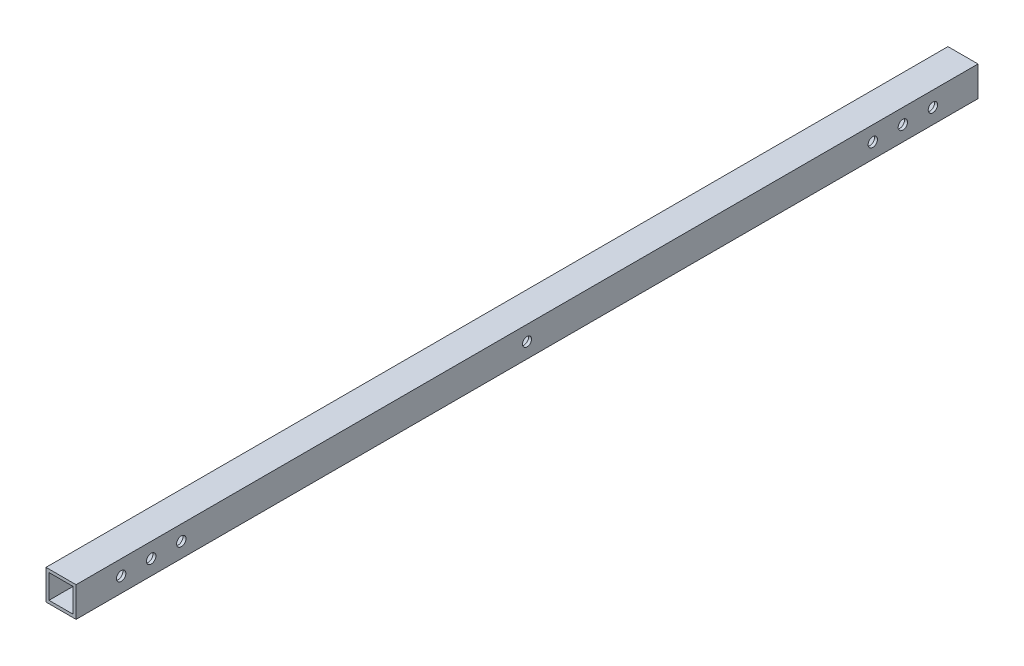
ISO-10303-21;
HEADER;
FILE_DESCRIPTION(('STEP AP214'),'2;1');
FILE_NAME('part.step','',(''),(''),'','','');
FILE_SCHEMA(('AUTOMOTIVE_DESIGN { 1 0 10303 214 1 1 1 1 }'));
ENDSEC;
DATA;
#1=APPLICATION_CONTEXT('core data for automotive mechanical design processes');
#2=APPLICATION_PROTOCOL_DEFINITION('international standard','automotive_design',2000,#1);
#3=PRODUCT_CONTEXT('',#1,'mechanical');
#4=PRODUCT('Part','Part','',(#3));
#5=PRODUCT_RELATED_PRODUCT_CATEGORY('part','',(#4));
#6=PRODUCT_DEFINITION_FORMATION('','',#4);
#7=PRODUCT_DEFINITION_CONTEXT('part definition',#1,'design');
#8=PRODUCT_DEFINITION('design','',#6,#7);
#9=PRODUCT_DEFINITION_SHAPE('','',#8);
#10=(LENGTH_UNIT() NAMED_UNIT(*) SI_UNIT(.MILLI.,.METRE.));
#11=(NAMED_UNIT(*) PLANE_ANGLE_UNIT() SI_UNIT($,.RADIAN.));
#12=(NAMED_UNIT(*) SI_UNIT($,.STERADIAN.) SOLID_ANGLE_UNIT());
#13=UNCERTAINTY_MEASURE_WITH_UNIT(LENGTH_MEASURE(1.E-05),#10,'distance_accuracy_value','');
#14=(GEOMETRIC_REPRESENTATION_CONTEXT(3) GLOBAL_UNCERTAINTY_ASSIGNED_CONTEXT((#13)) GLOBAL_UNIT_ASSIGNED_CONTEXT((#10,
#11,#12)) REPRESENTATION_CONTEXT('',''));
#15=CARTESIAN_POINT('',(0.,0.,0.));
#16=DIRECTION('',(0.,0.,1.));
#17=DIRECTION('',(1.,0.,0.));
#18=AXIS2_PLACEMENT_3D('',#15,#16,#17);
#19=CARTESIAN_POINT('',(10.,0.135119806497659,39.9728269370058));
#20=DIRECTION('',(-1.,0.,0.));
#21=DIRECTION('',(0.,0.,1.));
#22=AXIS2_PLACEMENT_3D('',#19,#20,#21);
#23=CYLINDRICAL_SURFACE('',#22,1.55843393281074);
#24=CARTESIAN_POINT('',(0.999999999999999,0.135119806497659,39.9728269370058));
#25=DIRECTION('',(-1.,0.,0.));
#26=DIRECTION('',(0.,-1.,0.));
#27=AXIS2_PLACEMENT_3D('',#24,#25,#26);
#28=CIRCLE('',#27,1.55843393281074);
#29=CARTESIAN_POINT('',(0.999999999999999,-1.42331412631308,39.9728269370058));
#30=VERTEX_POINT('',#29);
#31=EDGE_CURVE('E174',#30,#30,#28,.T.);
#32=ORIENTED_EDGE('',*,*,#31,.F.);
#33=EDGE_LOOP('',(#32));
#34=FACE_BOUND('',#33,.T.);
#35=CARTESIAN_POINT('',(0.,0.135119806497659,39.9728269370058));
#36=DIRECTION('',(1.,0.,0.));
#37=DIRECTION('',(0.,0.,-1.));
#38=AXIS2_PLACEMENT_3D('',#35,#36,#37);
#39=CIRCLE('',#38,1.55843393281074);
#40=CARTESIAN_POINT('',(0.,0.135119806497659,38.4143930041951));
#41=VERTEX_POINT('',#40);
#42=EDGE_CURVE('E211',#41,#41,#39,.T.);
#43=ORIENTED_EDGE('',*,*,#42,.F.);
#44=EDGE_LOOP('',(#43));
#45=FACE_BOUND('',#44,.T.);
#46=ADVANCED_FACE('F36',(#34,#45),#23,.F.);
#47=CARTESIAN_POINT('',(10.,0.135119806497659,29.9728269370058));
#48=DIRECTION('',(-1.,0.,0.));
#49=DIRECTION('',(0.,0.,1.));
#50=AXIS2_PLACEMENT_3D('',#47,#48,#49);
#51=CYLINDRICAL_SURFACE('',#50,1.55843393281074);
#52=CARTESIAN_POINT('',(0.999999999999999,0.135119806497659,29.9728269370058));
#53=DIRECTION('',(-1.,0.,0.));
#54=DIRECTION('',(0.,-1.,0.));
#55=AXIS2_PLACEMENT_3D('',#52,#53,#54);
#56=CIRCLE('',#55,1.55843393281074);
#57=CARTESIAN_POINT('',(0.999999999999999,-1.42331412631308,29.9728269370058));
#58=VERTEX_POINT('',#57);
#59=EDGE_CURVE('E171',#58,#58,#56,.T.);
#60=ORIENTED_EDGE('',*,*,#59,.F.);
#61=EDGE_LOOP('',(#60));
#62=FACE_BOUND('',#61,.T.);
#63=CARTESIAN_POINT('',(0.,0.135119806497659,29.9728269370058));
#64=DIRECTION('',(1.,0.,0.));
#65=DIRECTION('',(0.,0.,-1.));
#66=AXIS2_PLACEMENT_3D('',#63,#64,#65);
#67=CIRCLE('',#66,1.55843393281074);
#68=CARTESIAN_POINT('',(0.,0.135119806497659,28.4143930041951));
#69=VERTEX_POINT('',#68);
#70=EDGE_CURVE('E205',#69,#69,#67,.T.);
#71=ORIENTED_EDGE('',*,*,#70,.F.);
#72=EDGE_LOOP('',(#71));
#73=FACE_BOUND('',#72,.T.);
#74=ADVANCED_FACE('F266',(#62,#73),#51,.F.);
#75=CARTESIAN_POINT('',(10.,0.135119806497659,19.9728269370058));
#76=DIRECTION('',(-1.,0.,0.));
#77=DIRECTION('',(0.,0.,1.));
#78=AXIS2_PLACEMENT_3D('',#75,#76,#77);
#79=CYLINDRICAL_SURFACE('',#78,1.55843393281074);
#80=CARTESIAN_POINT('',(0.999999999999999,0.135119806497659,19.9728269370058));
#81=DIRECTION('',(-1.,0.,0.));
#82=DIRECTION('',(0.,-1.,0.));
#83=AXIS2_PLACEMENT_3D('',#80,#81,#82);
#84=CIRCLE('',#83,1.55843393281074);
#85=CARTESIAN_POINT('',(0.999999999999999,-1.42331412631308,19.9728269370058));
#86=VERTEX_POINT('',#85);
#87=EDGE_CURVE('E168',#86,#86,#84,.T.);
#88=ORIENTED_EDGE('',*,*,#87,.F.);
#89=EDGE_LOOP('',(#88));
#90=FACE_BOUND('',#89,.T.);
#91=CARTESIAN_POINT('',(0.,0.135119806497659,19.9728269370058));
#92=DIRECTION('',(1.,0.,0.));
#93=DIRECTION('',(0.,0.,-1.));
#94=AXIS2_PLACEMENT_3D('',#91,#92,#93);
#95=CIRCLE('',#94,1.55843393281074);
#96=CARTESIAN_POINT('',(0.,0.135119806497659,18.414393004195));
#97=VERTEX_POINT('',#96);
#98=EDGE_CURVE('E199',#97,#97,#95,.T.);
#99=ORIENTED_EDGE('',*,*,#98,.F.);
#100=EDGE_LOOP('',(#99));
#101=FACE_BOUND('',#100,.T.);
#102=ADVANCED_FACE('F273',(#90,#101),#79,.F.);
#103=CARTESIAN_POINT('',(10.,0.135119806497659,-210.027173062994));
#104=DIRECTION('',(-1.,0.,0.));
#105=DIRECTION('',(0.,0.,1.));
#106=AXIS2_PLACEMENT_3D('',#103,#104,#105);
#107=CYLINDRICAL_SURFACE('',#106,1.55843393281073);
#108=CARTESIAN_POINT('',(0.999999999999999,0.135119806497659,-210.027173062994));
#109=DIRECTION('',(-1.,0.,0.));
#110=DIRECTION('',(0.,-1.,0.));
#111=AXIS2_PLACEMENT_3D('',#108,#109,#110);
#112=CIRCLE('',#111,1.55843393281073);
#113=CARTESIAN_POINT('',(0.999999999999999,-1.42331412631307,-210.027173062994));
#114=VERTEX_POINT('',#113);
#115=EDGE_CURVE('E165',#114,#114,#112,.T.);
#116=ORIENTED_EDGE('',*,*,#115,.F.);
#117=EDGE_LOOP('',(#116));
#118=FACE_BOUND('',#117,.T.);
#119=CARTESIAN_POINT('',(0.,0.135119806497659,-210.027173062994));
#120=DIRECTION('',(1.,0.,0.));
#121=DIRECTION('',(0.,0.,1.));
#122=AXIS2_PLACEMENT_3D('',#119,#120,#121);
#123=CIRCLE('',#122,1.55843393281073);
#124=CARTESIAN_POINT('',(0.,0.135119806497659,-208.468739130183));
#125=VERTEX_POINT('',#124);
#126=EDGE_CURVE('E193',#125,#125,#123,.T.);
#127=ORIENTED_EDGE('',*,*,#126,.F.);
#128=EDGE_LOOP('',(#127));
#129=FACE_BOUND('',#128,.T.);
#130=ADVANCED_FACE('F333',(#118,#129),#107,.F.);
#131=CARTESIAN_POINT('',(10.,0.135119806497659,-220.027173062994));
#132=DIRECTION('',(-1.,0.,0.));
#133=DIRECTION('',(0.,0.,1.));
#134=AXIS2_PLACEMENT_3D('',#131,#132,#133);
#135=CYLINDRICAL_SURFACE('',#134,1.55843393281078);
#136=CARTESIAN_POINT('',(0.999999999999999,0.135119806497659,-220.027173062994));
#137=DIRECTION('',(-1.,0.,0.));
#138=DIRECTION('',(0.,-1.,0.));
#139=AXIS2_PLACEMENT_3D('',#136,#137,#138);
#140=CIRCLE('',#139,1.55843393281078);
#141=CARTESIAN_POINT('',(0.999999999999999,-1.42331412631312,-220.027173062994));
#142=VERTEX_POINT('',#141);
#143=EDGE_CURVE('E162',#142,#142,#140,.T.);
#144=ORIENTED_EDGE('',*,*,#143,.F.);
#145=EDGE_LOOP('',(#144));
#146=FACE_BOUND('',#145,.T.);
#147=CARTESIAN_POINT('',(0.,0.135119806497659,-220.027173062994));
#148=DIRECTION('',(1.,0.,0.));
#149=DIRECTION('',(0.,0.,1.));
#150=AXIS2_PLACEMENT_3D('',#147,#148,#149);
#151=CIRCLE('',#150,1.55843393281078);
#152=CARTESIAN_POINT('',(0.,0.135119806497659,-218.468739130183));
#153=VERTEX_POINT('',#152);
#154=EDGE_CURVE('E187',#153,#153,#151,.T.);
#155=ORIENTED_EDGE('',*,*,#154,.F.);
#156=EDGE_LOOP('',(#155));
#157=FACE_BOUND('',#156,.T.);
#158=ADVANCED_FACE('F324',(#146,#157),#135,.F.);
#159=CARTESIAN_POINT('',(10.,0.135119806497659,-230.027173062994));
#160=DIRECTION('',(-1.,0.,0.));
#161=DIRECTION('',(0.,0.,1.));
#162=AXIS2_PLACEMENT_3D('',#159,#160,#161);
#163=CYLINDRICAL_SURFACE('',#162,1.55843393281076);
#164=CARTESIAN_POINT('',(0.999999999999999,0.135119806497659,-230.027173062994));
#165=DIRECTION('',(-1.,0.,0.));
#166=DIRECTION('',(0.,-1.,0.));
#167=AXIS2_PLACEMENT_3D('',#164,#165,#166);
#168=CIRCLE('',#167,1.55843393281076);
#169=CARTESIAN_POINT('',(0.999999999999999,-1.4233141263131,-230.027173062994));
#170=VERTEX_POINT('',#169);
#171=EDGE_CURVE('E159',#170,#170,#168,.T.);
#172=ORIENTED_EDGE('',*,*,#171,.F.);
#173=EDGE_LOOP('',(#172));
#174=FACE_BOUND('',#173,.T.);
#175=CARTESIAN_POINT('',(0.,0.135119806497659,-230.027173062994));
#176=DIRECTION('',(1.,0.,0.));
#177=DIRECTION('',(0.,0.,1.));
#178=AXIS2_PLACEMENT_3D('',#175,#176,#177);
#179=CIRCLE('',#178,1.55843393281076);
#180=CARTESIAN_POINT('',(0.,0.135119806497659,-228.468739130183));
#181=VERTEX_POINT('',#180);
#182=EDGE_CURVE('E181',#181,#181,#179,.T.);
#183=ORIENTED_EDGE('',*,*,#182,.F.);
#184=EDGE_LOOP('',(#183));
#185=FACE_BOUND('',#184,.T.);
#186=ADVANCED_FACE('F315',(#174,#185),#163,.F.);
#187=CARTESIAN_POINT('',(0.,0.135119806497659,-95.0271730629942));
#188=DIRECTION('',(1.,0.,0.));
#189=DIRECTION('',(0.,0.,-1.));
#190=AXIS2_PLACEMENT_3D('',#187,#188,#189);
#191=CYLINDRICAL_SURFACE('',#190,1.5);
#192=CARTESIAN_POINT('',(1.,0.135119806497659,-95.0271730629942));
#193=DIRECTION('',(-1.,0.,0.));
#194=DIRECTION('',(0.,-1.,0.));
#195=AXIS2_PLACEMENT_3D('',#192,#193,#194);
#196=CIRCLE('',#195,1.5);
#197=CARTESIAN_POINT('',(1.,-1.36488019350234,-95.0271730629942));
#198=VERTEX_POINT('',#197);
#199=EDGE_CURVE('E40',#198,#198,#196,.F.);
#200=ORIENTED_EDGE('',*,*,#199,.T.);
#201=EDGE_LOOP('',(#200));
#202=FACE_BOUND('',#201,.T.);
#203=CARTESIAN_POINT('',(0.,0.135119806497659,-95.0271730629942));
#204=DIRECTION('',(1.,0.,0.));
#205=DIRECTION('',(0.,0.,-1.));
#206=AXIS2_PLACEMENT_3D('',#203,#204,#205);
#207=CIRCLE('',#206,1.5);
#208=CARTESIAN_POINT('',(0.,0.135119806497659,-96.5271730629942));
#209=VERTEX_POINT('',#208);
#210=EDGE_CURVE('E178',#209,#209,#207,.T.);
#211=ORIENTED_EDGE('',*,*,#210,.F.);
#212=EDGE_LOOP('',(#211));
#213=FACE_BOUND('',#212,.T.);
#214=ADVANCED_FACE('F299',(#202,#213),#191,.F.);
#215=CARTESIAN_POINT('',(10.,0.,0.));
#216=DIRECTION('',(1.,0.,0.));
#217=DIRECTION('',(0.,0.,-1.));
#218=AXIS2_PLACEMENT_3D('',#215,#216,#217);
#219=PLANE('',#218);
#220=CARTESIAN_POINT('',(10.,0.135119806497659,-95.0271730629942));
#221=DIRECTION('',(1.,0.,0.));
#222=DIRECTION('',(0.,0.,-1.));
#223=AXIS2_PLACEMENT_3D('',#220,#221,#222);
#224=CIRCLE('',#223,1.5);
#225=CARTESIAN_POINT('',(10.,0.135119806497659,-96.5271730629942));
#226=VERTEX_POINT('',#225);
#227=EDGE_CURVE('E177',#226,#226,#224,.T.);
#228=ORIENTED_EDGE('',*,*,#227,.F.);
#229=EDGE_LOOP('',(#228));
#230=FACE_BOUND('',#229,.T.);
#231=CARTESIAN_POINT('',(10.,0.135119806497659,-220.027173062994));
#232=DIRECTION('',(1.,0.,0.));
#233=DIRECTION('',(0.,0.,1.));
#234=AXIS2_PLACEMENT_3D('',#231,#232,#233);
#235=CIRCLE('',#234,1.55843393281078);
#236=CARTESIAN_POINT('',(10.,0.135119806497659,-218.468739130183));
#237=VERTEX_POINT('',#236);
#238=EDGE_CURVE('E190',#237,#237,#235,.T.);
#239=ORIENTED_EDGE('',*,*,#238,.F.);
#240=EDGE_LOOP('',(#239));
#241=FACE_BOUND('',#240,.T.);
#242=CARTESIAN_POINT('',(10.,0.135119806497659,19.9728269370058));
#243=DIRECTION('',(1.,0.,0.));
#244=DIRECTION('',(0.,0.,-1.));
#245=AXIS2_PLACEMENT_3D('',#242,#243,#244);
#246=CIRCLE('',#245,1.55843393281074);
#247=CARTESIAN_POINT('',(10.,0.135119806497659,18.414393004195));
#248=VERTEX_POINT('',#247);
#249=EDGE_CURVE('E202',#248,#248,#246,.T.);
#250=ORIENTED_EDGE('',*,*,#249,.F.);
#251=EDGE_LOOP('',(#250));
#252=FACE_BOUND('',#251,.T.);
#253=CARTESIAN_POINT('',(10.,0.135119806497659,39.9728269370058));
#254=DIRECTION('',(1.,0.,0.));
#255=DIRECTION('',(0.,0.,-1.));
#256=AXIS2_PLACEMENT_3D('',#253,#254,#255);
#257=CIRCLE('',#256,1.55843393281074);
#258=CARTESIAN_POINT('',(10.,0.135119806497659,38.4143930041951));
#259=VERTEX_POINT('',#258);
#260=EDGE_CURVE('E214',#259,#259,#257,.T.);
#261=ORIENTED_EDGE('',*,*,#260,.F.);
#262=EDGE_LOOP('',(#261));
#263=FACE_BOUND('',#262,.T.);
#264=DIRECTION('',(0.,-1.,0.));
#265=VECTOR('',#264,1.);
#266=CARTESIAN_POINT('',(10.,5.13511980649766,54.9728269370058));
#267=LINE('',#266,#265);
#268=CARTESIAN_POINT('',(10.,5.13511980649766,54.9728269370058));
#269=VERTEX_POINT('',#268);
#270=CARTESIAN_POINT('',(10.,-4.86488019350234,54.9728269370058));
#271=VERTEX_POINT('',#270);
#272=EDGE_CURVE('E220',#269,#271,#267,.T.);
#273=ORIENTED_EDGE('',*,*,#272,.T.);
#274=DIRECTION('',(0.,0.,-1.));
#275=VECTOR('',#274,1.);
#276=CARTESIAN_POINT('',(10.,-4.86488019350234,54.9728269370058));
#277=LINE('',#276,#275);
#278=CARTESIAN_POINT('',(10.,-4.86488019350234,-245.027173062994));
#279=VERTEX_POINT('',#278);
#280=EDGE_CURVE('E223',#271,#279,#277,.T.);
#281=ORIENTED_EDGE('',*,*,#280,.T.);
#282=DIRECTION('',(0.,1.,0.));
#283=VECTOR('',#282,1.);
#284=CARTESIAN_POINT('',(10.,5.13511980649766,-245.027173062994));
#285=LINE('',#284,#283);
#286=CARTESIAN_POINT('',(10.,5.13511980649766,-245.027173062994));
#287=VERTEX_POINT('',#286);
#288=EDGE_CURVE('E226',#279,#287,#285,.T.);
#289=ORIENTED_EDGE('',*,*,#288,.T.);
#290=DIRECTION('',(0.,0.,1.));
#291=VECTOR('',#290,1.);
#292=CARTESIAN_POINT('',(10.,5.13511980649766,54.9728269370058));
#293=LINE('',#292,#291);
#294=EDGE_CURVE('E228',#287,#269,#293,.T.);
#295=ORIENTED_EDGE('',*,*,#294,.T.);
#296=EDGE_LOOP('',(#273,#281,#289,#295));
#297=FACE_BOUND('',#296,.T.);
#298=CARTESIAN_POINT('',(10.,0.135119806497659,29.9728269370058));
#299=DIRECTION('',(1.,0.,0.));
#300=DIRECTION('',(0.,0.,-1.));
#301=AXIS2_PLACEMENT_3D('',#298,#299,#300);
#302=CIRCLE('',#301,1.55843393281074);
#303=CARTESIAN_POINT('',(10.,0.135119806497659,28.4143930041951));
#304=VERTEX_POINT('',#303);
#305=EDGE_CURVE('E208',#304,#304,#302,.T.);
#306=ORIENTED_EDGE('',*,*,#305,.F.);
#307=EDGE_LOOP('',(#306));
#308=FACE_BOUND('',#307,.T.);
#309=CARTESIAN_POINT('',(10.,0.135119806497659,-210.027173062994));
#310=DIRECTION('',(1.,0.,0.));
#311=DIRECTION('',(0.,0.,1.));
#312=AXIS2_PLACEMENT_3D('',#309,#310,#311);
#313=CIRCLE('',#312,1.55843393281073);
#314=CARTESIAN_POINT('',(10.,0.135119806497659,-208.468739130183));
#315=VERTEX_POINT('',#314);
#316=EDGE_CURVE('E196',#315,#315,#313,.T.);
#317=ORIENTED_EDGE('',*,*,#316,.F.);
#318=EDGE_LOOP('',(#317));
#319=FACE_BOUND('',#318,.T.);
#320=CARTESIAN_POINT('',(10.,0.135119806497659,-230.027173062994));
#321=DIRECTION('',(1.,0.,0.));
#322=DIRECTION('',(0.,0.,1.));
#323=AXIS2_PLACEMENT_3D('',#320,#321,#322);
#324=CIRCLE('',#323,1.55843393281076);
#325=CARTESIAN_POINT('',(10.,0.135119806497659,-228.468739130183));
#326=VERTEX_POINT('',#325);
#327=EDGE_CURVE('E184',#326,#326,#324,.T.);
#328=ORIENTED_EDGE('',*,*,#327,.F.);
#329=EDGE_LOOP('',(#328));
#330=FACE_BOUND('',#329,.T.);
#331=ADVANCED_FACE('F295',(#230,#241,#252,#263,#297,#308,#319,#330),#219,.T.);
#332=CARTESIAN_POINT('',(0.,0.,0.));
#333=DIRECTION('',(1.,0.,0.));
#334=DIRECTION('',(0.,0.,-1.));
#335=AXIS2_PLACEMENT_3D('',#332,#333,#334);
#336=PLANE('',#335);
#337=ORIENTED_EDGE('',*,*,#210,.T.);
#338=EDGE_LOOP('',(#337));
#339=FACE_BOUND('',#338,.T.);
#340=DIRECTION('',(0.,-1.,0.));
#341=VECTOR('',#340,1.);
#342=CARTESIAN_POINT('',(0.,5.13511980649766,54.9728269370058));
#343=LINE('',#342,#341);
#344=CARTESIAN_POINT('',(0.,5.13511980649766,54.9728269370058));
#345=VERTEX_POINT('',#344);
#346=CARTESIAN_POINT('',(0.,-4.86488019350234,54.9728269370058));
#347=VERTEX_POINT('',#346);
#348=EDGE_CURVE('E217',#345,#347,#343,.T.);
#349=ORIENTED_EDGE('',*,*,#348,.F.);
#350=DIRECTION('',(0.,0.,1.));
#351=VECTOR('',#350,1.);
#352=CARTESIAN_POINT('',(0.,5.13511980649766,54.9728269370058));
#353=LINE('',#352,#351);
#354=CARTESIAN_POINT('',(0.,5.13511980649766,-245.027173062994));
#355=VERTEX_POINT('',#354);
#356=EDGE_CURVE('E224',#355,#345,#353,.T.);
#357=ORIENTED_EDGE('',*,*,#356,.F.);
#358=DIRECTION('',(0.,1.,0.));
#359=VECTOR('',#358,1.);
#360=CARTESIAN_POINT('',(0.,5.13511980649766,-245.027173062994));
#361=LINE('',#360,#359);
#362=CARTESIAN_POINT('',(0.,-4.86488019350234,-245.027173062994));
#363=VERTEX_POINT('',#362);
#364=EDGE_CURVE('E235',#363,#355,#361,.T.);
#365=ORIENTED_EDGE('',*,*,#364,.F.);
#366=DIRECTION('',(0.,0.,-1.));
#367=VECTOR('',#366,1.);
#368=CARTESIAN_POINT('',(0.,-4.86488019350234,54.9728269370058));
#369=LINE('',#368,#367);
#370=EDGE_CURVE('E233',#347,#363,#369,.T.);
#371=ORIENTED_EDGE('',*,*,#370,.F.);
#372=EDGE_LOOP('',(#349,#357,#365,#371));
#373=FACE_BOUND('',#372,.T.);
#374=ORIENTED_EDGE('',*,*,#42,.T.);
#375=EDGE_LOOP('',(#374));
#376=FACE_BOUND('',#375,.T.);
#377=ORIENTED_EDGE('',*,*,#70,.T.);
#378=EDGE_LOOP('',(#377));
#379=FACE_BOUND('',#378,.T.);
#380=ORIENTED_EDGE('',*,*,#98,.T.);
#381=EDGE_LOOP('',(#380));
#382=FACE_BOUND('',#381,.T.);
#383=ORIENTED_EDGE('',*,*,#126,.T.);
#384=EDGE_LOOP('',(#383));
#385=FACE_BOUND('',#384,.T.);
#386=ORIENTED_EDGE('',*,*,#154,.T.);
#387=EDGE_LOOP('',(#386));
#388=FACE_BOUND('',#387,.T.);
#389=ORIENTED_EDGE('',*,*,#182,.T.);
#390=EDGE_LOOP('',(#389));
#391=FACE_BOUND('',#390,.T.);
#392=ADVANCED_FACE('F298',(#339,#373,#376,#379,#382,#385,#388,#391),#336,.F.);
#393=CARTESIAN_POINT('',(10.,5.13511980649766,54.9728269370058));
#394=DIRECTION('',(0.,0.,-1.));
#395=DIRECTION('',(-1.,0.,0.));
#396=AXIS2_PLACEMENT_3D('',#393,#394,#395);
#397=PLANE('',#396);
#398=DIRECTION('',(1.,0.,0.));
#399=VECTOR('',#398,1.);
#400=CARTESIAN_POINT('',(1.,-3.86488019350234,54.9728269370058));
#401=LINE('',#400,#399);
#402=CARTESIAN_POINT('',(1.,-3.86488019350234,54.9728269370058));
#403=VERTEX_POINT('',#402);
#404=CARTESIAN_POINT('',(9.00000000000001,-3.86488019350234,54.9728269370058));
#405=VERTEX_POINT('',#404);
#406=EDGE_CURVE('E131',#403,#405,#401,.T.);
#407=ORIENTED_EDGE('',*,*,#406,.F.);
#408=DIRECTION('',(0.,-1.,0.));
#409=VECTOR('',#408,1.);
#410=CARTESIAN_POINT('',(1.,4.13511980649766,54.9728269370058));
#411=LINE('',#410,#409);
#412=CARTESIAN_POINT('',(1.,4.13511980649766,54.9728269370058));
#413=VERTEX_POINT('',#412);
#414=EDGE_CURVE('E53',#413,#403,#411,.T.);
#415=ORIENTED_EDGE('',*,*,#414,.F.);
#416=DIRECTION('',(-1.,0.,0.));
#417=VECTOR('',#416,1.);
#418=CARTESIAN_POINT('',(1.,4.13511980649766,54.9728269370058));
#419=LINE('',#418,#417);
#420=CARTESIAN_POINT('',(9.,4.13511980649766,54.9728269370058));
#421=VERTEX_POINT('',#420);
#422=EDGE_CURVE('E122',#421,#413,#419,.T.);
#423=ORIENTED_EDGE('',*,*,#422,.F.);
#424=DIRECTION('',(0.,1.,0.));
#425=VECTOR('',#424,1.);
#426=CARTESIAN_POINT('',(9.,4.13511980649766,54.9728269370058));
#427=LINE('',#426,#425);
#428=EDGE_CURVE('E125',#405,#421,#427,.T.);
#429=ORIENTED_EDGE('',*,*,#428,.F.);
#430=EDGE_LOOP('',(#407,#415,#423,#429));
#431=FACE_BOUND('',#430,.T.);
#432=ORIENTED_EDGE('',*,*,#348,.T.);
#433=DIRECTION('',(-1.,0.,0.));
#434=VECTOR('',#433,1.);
#435=CARTESIAN_POINT('',(10.,-4.86488019350234,54.9728269370058));
#436=LINE('',#435,#434);
#437=EDGE_CURVE('E11',#271,#347,#436,.T.);
#438=ORIENTED_EDGE('',*,*,#437,.F.);
#439=ORIENTED_EDGE('',*,*,#272,.F.);
#440=DIRECTION('',(-1.,0.,0.));
#441=VECTOR('',#440,1.);
#442=CARTESIAN_POINT('',(10.,5.13511980649766,54.9728269370058));
#443=LINE('',#442,#441);
#444=EDGE_CURVE('E230',#269,#345,#443,.T.);
#445=ORIENTED_EDGE('',*,*,#444,.T.);
#446=EDGE_LOOP('',(#432,#438,#439,#445));
#447=FACE_BOUND('',#446,.T.);
#448=ADVANCED_FACE('F38',(#431,#447),#397,.F.);
#449=CARTESIAN_POINT('',(10.,-4.86488019350234,54.9728269370058));
#450=DIRECTION('',(0.,1.,0.));
#451=DIRECTION('',(0.,0.,1.));
#452=AXIS2_PLACEMENT_3D('',#449,#450,#451);
#453=PLANE('',#452);
#454=ORIENTED_EDGE('',*,*,#370,.T.);
#455=DIRECTION('',(-1.,0.,0.));
#456=VECTOR('',#455,1.);
#457=CARTESIAN_POINT('',(10.,-4.86488019350234,-245.027173062994));
#458=LINE('',#457,#456);
#459=EDGE_CURVE('E45',#279,#363,#458,.T.);
#460=ORIENTED_EDGE('',*,*,#459,.F.);
#461=ORIENTED_EDGE('',*,*,#280,.F.);
#462=ORIENTED_EDGE('',*,*,#437,.T.);
#463=EDGE_LOOP('',(#454,#460,#461,#462));
#464=FACE_BOUND('',#463,.T.);
#465=ADVANCED_FACE('F345',(#464),#453,.F.);
#466=CARTESIAN_POINT('',(10.,5.13511980649766,-245.027173062994));
#467=DIRECTION('',(0.,0.,1.));
#468=DIRECTION('',(1.,0.,0.));
#469=AXIS2_PLACEMENT_3D('',#466,#467,#468);
#470=PLANE('',#469);
#471=DIRECTION('',(-1.,0.,0.));
#472=VECTOR('',#471,1.);
#473=CARTESIAN_POINT('',(1.,4.13511980649766,-245.027173062994));
#474=LINE('',#473,#472);
#475=CARTESIAN_POINT('',(9.,4.13511980649766,-245.027173062994));
#476=VERTEX_POINT('',#475);
#477=CARTESIAN_POINT('',(1.,4.13511980649766,-245.027173062994));
#478=VERTEX_POINT('',#477);
#479=EDGE_CURVE('E112',#476,#478,#474,.T.);
#480=ORIENTED_EDGE('',*,*,#479,.T.);
#481=DIRECTION('',(0.,-1.,0.));
#482=VECTOR('',#481,1.);
#483=CARTESIAN_POINT('',(1.,4.13511980649766,-245.027173062994));
#484=LINE('',#483,#482);
#485=CARTESIAN_POINT('',(1.,-3.86488019350234,-245.027173062994));
#486=VERTEX_POINT('',#485);
#487=EDGE_CURVE('E106',#478,#486,#484,.T.);
#488=ORIENTED_EDGE('',*,*,#487,.T.);
#489=DIRECTION('',(1.,0.,0.));
#490=VECTOR('',#489,1.);
#491=CARTESIAN_POINT('',(1.,-3.86488019350234,-245.027173062994));
#492=LINE('',#491,#490);
#493=CARTESIAN_POINT('',(9.00000000000001,-3.86488019350234,-245.027173062994));
#494=VERTEX_POINT('',#493);
#495=EDGE_CURVE('E115',#486,#494,#492,.T.);
#496=ORIENTED_EDGE('',*,*,#495,.T.);
#497=DIRECTION('',(0.,1.,0.));
#498=VECTOR('',#497,1.);
#499=CARTESIAN_POINT('',(9.,4.13511980649766,-245.027173062994));
#500=LINE('',#499,#498);
#501=EDGE_CURVE('E61',#494,#476,#500,.T.);
#502=ORIENTED_EDGE('',*,*,#501,.T.);
#503=EDGE_LOOP('',(#480,#488,#496,#502));
#504=FACE_BOUND('',#503,.T.);
#505=ORIENTED_EDGE('',*,*,#364,.T.);
#506=DIRECTION('',(-1.,0.,0.));
#507=VECTOR('',#506,1.);
#508=CARTESIAN_POINT('',(10.,5.13511980649766,-245.027173062994));
#509=LINE('',#508,#507);
#510=EDGE_CURVE('E240',#287,#355,#509,.T.);
#511=ORIENTED_EDGE('',*,*,#510,.F.);
#512=ORIENTED_EDGE('',*,*,#288,.F.);
#513=ORIENTED_EDGE('',*,*,#459,.T.);
#514=EDGE_LOOP('',(#505,#511,#512,#513));
#515=FACE_BOUND('',#514,.T.);
#516=ADVANCED_FACE('F119',(#504,#515),#470,.F.);
#517=CARTESIAN_POINT('',(10.,5.13511980649766,54.9728269370058));
#518=DIRECTION('',(0.,-1.,0.));
#519=DIRECTION('',(0.,0.,-1.));
#520=AXIS2_PLACEMENT_3D('',#517,#518,#519);
#521=PLANE('',#520);
#522=ORIENTED_EDGE('',*,*,#356,.T.);
#523=ORIENTED_EDGE('',*,*,#444,.F.);
#524=ORIENTED_EDGE('',*,*,#294,.F.);
#525=ORIENTED_EDGE('',*,*,#510,.T.);
#526=EDGE_LOOP('',(#522,#523,#524,#525));
#527=FACE_BOUND('',#526,.T.);
#528=ADVANCED_FACE('F281',(#527),#521,.F.);
#529=CARTESIAN_POINT('',(9.,0.135119806497659,39.9728269370058));
#530=DIRECTION('',(1.,0.,0.));
#531=DIRECTION('',(0.,1.,0.));
#532=AXIS2_PLACEMENT_3D('',#529,#530,#531);
#533=CIRCLE('',#532,1.55843393281074);
#534=CARTESIAN_POINT('',(9.,1.6935537393084,39.9728269370058));
#535=VERTEX_POINT('',#534);
#536=EDGE_CURVE('E156',#535,#535,#533,.T.);
#537=ORIENTED_EDGE('',*,*,#536,.F.);
#538=EDGE_LOOP('',(#537));
#539=FACE_BOUND('',#538,.T.);
#540=ORIENTED_EDGE('',*,*,#260,.T.);
#541=EDGE_LOOP('',(#540));
#542=FACE_BOUND('',#541,.T.);
#543=ADVANCED_FACE('F269',(#539,#542),#23,.F.);
#544=CARTESIAN_POINT('',(9.,0.135119806497659,29.9728269370058));
#545=DIRECTION('',(1.,0.,0.));
#546=DIRECTION('',(0.,1.,0.));
#547=AXIS2_PLACEMENT_3D('',#544,#545,#546);
#548=CIRCLE('',#547,1.55843393281074);
#549=CARTESIAN_POINT('',(9.,1.6935537393084,29.9728269370058));
#550=VERTEX_POINT('',#549);
#551=EDGE_CURVE('E153',#550,#550,#548,.T.);
#552=ORIENTED_EDGE('',*,*,#551,.F.);
#553=EDGE_LOOP('',(#552));
#554=FACE_BOUND('',#553,.T.);
#555=ORIENTED_EDGE('',*,*,#305,.T.);
#556=EDGE_LOOP('',(#555));
#557=FACE_BOUND('',#556,.T.);
#558=ADVANCED_FACE('F276',(#554,#557),#51,.F.);
#559=CARTESIAN_POINT('',(9.,0.135119806497659,19.9728269370058));
#560=DIRECTION('',(1.,0.,0.));
#561=DIRECTION('',(0.,1.,0.));
#562=AXIS2_PLACEMENT_3D('',#559,#560,#561);
#563=CIRCLE('',#562,1.55843393281074);
#564=CARTESIAN_POINT('',(9.,1.6935537393084,19.9728269370058));
#565=VERTEX_POINT('',#564);
#566=EDGE_CURVE('E150',#565,#565,#563,.T.);
#567=ORIENTED_EDGE('',*,*,#566,.F.);
#568=EDGE_LOOP('',(#567));
#569=FACE_BOUND('',#568,.T.);
#570=ORIENTED_EDGE('',*,*,#249,.T.);
#571=EDGE_LOOP('',(#570));
#572=FACE_BOUND('',#571,.T.);
#573=ADVANCED_FACE('F287',(#569,#572),#79,.F.);
#574=CARTESIAN_POINT('',(9.,0.135119806497659,-210.027173062994));
#575=DIRECTION('',(1.,0.,0.));
#576=DIRECTION('',(0.,1.,0.));
#577=AXIS2_PLACEMENT_3D('',#574,#575,#576);
#578=CIRCLE('',#577,1.55843393281073);
#579=CARTESIAN_POINT('',(9.,1.69355373930839,-210.027173062994));
#580=VERTEX_POINT('',#579);
#581=EDGE_CURVE('E147',#580,#580,#578,.T.);
#582=ORIENTED_EDGE('',*,*,#581,.F.);
#583=EDGE_LOOP('',(#582));
#584=FACE_BOUND('',#583,.T.);
#585=ORIENTED_EDGE('',*,*,#316,.T.);
#586=EDGE_LOOP('',(#585));
#587=FACE_BOUND('',#586,.T.);
#588=ADVANCED_FACE('F321',(#584,#587),#107,.F.);
#589=CARTESIAN_POINT('',(9.,0.135119806497659,-220.027173062994));
#590=DIRECTION('',(1.,0.,0.));
#591=DIRECTION('',(0.,1.,0.));
#592=AXIS2_PLACEMENT_3D('',#589,#590,#591);
#593=CIRCLE('',#592,1.55843393281078);
#594=CARTESIAN_POINT('',(9.,1.69355373930844,-220.027173062994));
#595=VERTEX_POINT('',#594);
#596=EDGE_CURVE('E144',#595,#595,#593,.T.);
#597=ORIENTED_EDGE('',*,*,#596,.F.);
#598=EDGE_LOOP('',(#597));
#599=FACE_BOUND('',#598,.T.);
#600=ORIENTED_EDGE('',*,*,#238,.T.);
#601=EDGE_LOOP('',(#600));
#602=FACE_BOUND('',#601,.T.);
#603=ADVANCED_FACE('F312',(#599,#602),#135,.F.);
#604=CARTESIAN_POINT('',(9.,0.135119806497659,-230.027173062994));
#605=DIRECTION('',(1.,0.,0.));
#606=DIRECTION('',(0.,1.,0.));
#607=AXIS2_PLACEMENT_3D('',#604,#605,#606);
#608=CIRCLE('',#607,1.55843393281076);
#609=CARTESIAN_POINT('',(9.,1.69355373930841,-230.027173062994));
#610=VERTEX_POINT('',#609);
#611=EDGE_CURVE('E141',#610,#610,#608,.T.);
#612=ORIENTED_EDGE('',*,*,#611,.F.);
#613=EDGE_LOOP('',(#612));
#614=FACE_BOUND('',#613,.T.);
#615=ORIENTED_EDGE('',*,*,#327,.T.);
#616=EDGE_LOOP('',(#615));
#617=FACE_BOUND('',#616,.T.);
#618=ADVANCED_FACE('F310',(#614,#617),#163,.F.);
#619=CARTESIAN_POINT('',(9.,0.135119806497659,-95.0271730629942));
#620=DIRECTION('',(1.,0.,0.));
#621=DIRECTION('',(0.,1.,0.));
#622=AXIS2_PLACEMENT_3D('',#619,#620,#621);
#623=CIRCLE('',#622,1.5);
#624=CARTESIAN_POINT('',(9.,1.63511980649766,-95.0271730629942));
#625=VERTEX_POINT('',#624);
#626=EDGE_CURVE('E137',#625,#625,#623,.F.);
#627=ORIENTED_EDGE('',*,*,#626,.T.);
#628=EDGE_LOOP('',(#627));
#629=FACE_BOUND('',#628,.T.);
#630=ORIENTED_EDGE('',*,*,#227,.T.);
#631=EDGE_LOOP('',(#630));
#632=FACE_BOUND('',#631,.T.);
#633=ADVANCED_FACE('F247',(#629,#632),#191,.F.);
#634=CARTESIAN_POINT('',(1.,4.13511980649766,-245.027173062994));
#635=DIRECTION('',(-1.,0.,0.));
#636=DIRECTION('',(0.,-1.,0.));
#637=AXIS2_PLACEMENT_3D('',#634,#635,#636);
#638=PLANE('',#637);
#639=ORIENTED_EDGE('',*,*,#31,.T.);
#640=EDGE_LOOP('',(#639));
#641=FACE_BOUND('',#640,.T.);
#642=ORIENTED_EDGE('',*,*,#59,.T.);
#643=EDGE_LOOP('',(#642));
#644=FACE_BOUND('',#643,.T.);
#645=ORIENTED_EDGE('',*,*,#87,.T.);
#646=EDGE_LOOP('',(#645));
#647=FACE_BOUND('',#646,.T.);
#648=ORIENTED_EDGE('',*,*,#115,.T.);
#649=EDGE_LOOP('',(#648));
#650=FACE_BOUND('',#649,.T.);
#651=ORIENTED_EDGE('',*,*,#143,.T.);
#652=EDGE_LOOP('',(#651));
#653=FACE_BOUND('',#652,.T.);
#654=ORIENTED_EDGE('',*,*,#171,.T.);
#655=EDGE_LOOP('',(#654));
#656=FACE_BOUND('',#655,.T.);
#657=ORIENTED_EDGE('',*,*,#414,.T.);
#658=DIRECTION('',(0.,0.,1.));
#659=VECTOR('',#658,1.);
#660=CARTESIAN_POINT('',(1.,-3.86488019350234,-245.027173062994));
#661=LINE('',#660,#659);
#662=EDGE_CURVE('E101',#486,#403,#661,.T.);
#663=ORIENTED_EDGE('',*,*,#662,.F.);
#664=ORIENTED_EDGE('',*,*,#487,.F.);
#665=DIRECTION('',(0.,0.,1.));
#666=VECTOR('',#665,1.);
#667=CARTESIAN_POINT('',(1.,4.13511980649766,-245.027173062994));
#668=LINE('',#667,#666);
#669=EDGE_CURVE('E135',#478,#413,#668,.T.);
#670=ORIENTED_EDGE('',*,*,#669,.T.);
#671=EDGE_LOOP('',(#657,#663,#664,#670));
#672=FACE_BOUND('',#671,.T.);
#673=ORIENTED_EDGE('',*,*,#199,.F.);
#674=EDGE_LOOP('',(#673));
#675=FACE_BOUND('',#674,.T.);
#676=ADVANCED_FACE('F103',(#641,#644,#647,#650,#653,#656,#672,#675),#638,.F.);
#677=CARTESIAN_POINT('',(9.,4.13511980649766,-245.027173062994));
#678=DIRECTION('',(1.,0.,0.));
#679=DIRECTION('',(0.,1.,0.));
#680=AXIS2_PLACEMENT_3D('',#677,#678,#679);
#681=PLANE('',#680);
#682=ORIENTED_EDGE('',*,*,#536,.T.);
#683=EDGE_LOOP('',(#682));
#684=FACE_BOUND('',#683,.T.);
#685=ORIENTED_EDGE('',*,*,#551,.T.);
#686=EDGE_LOOP('',(#685));
#687=FACE_BOUND('',#686,.T.);
#688=ORIENTED_EDGE('',*,*,#566,.T.);
#689=EDGE_LOOP('',(#688));
#690=FACE_BOUND('',#689,.T.);
#691=ORIENTED_EDGE('',*,*,#581,.T.);
#692=EDGE_LOOP('',(#691));
#693=FACE_BOUND('',#692,.T.);
#694=ORIENTED_EDGE('',*,*,#596,.T.);
#695=EDGE_LOOP('',(#694));
#696=FACE_BOUND('',#695,.T.);
#697=ORIENTED_EDGE('',*,*,#611,.T.);
#698=EDGE_LOOP('',(#697));
#699=FACE_BOUND('',#698,.T.);
#700=ORIENTED_EDGE('',*,*,#428,.T.);
#701=DIRECTION('',(0.,0.,1.));
#702=VECTOR('',#701,1.);
#703=CARTESIAN_POINT('',(9.,4.13511980649766,-245.027173062994));
#704=LINE('',#703,#702);
#705=EDGE_CURVE('E138',#476,#421,#704,.T.);
#706=ORIENTED_EDGE('',*,*,#705,.F.);
#707=ORIENTED_EDGE('',*,*,#501,.F.);
#708=DIRECTION('',(0.,0.,1.));
#709=VECTOR('',#708,1.);
#710=CARTESIAN_POINT('',(9.00000000000001,-3.86488019350234,-245.027173062994));
#711=LINE('',#710,#709);
#712=EDGE_CURVE('E111',#494,#405,#711,.T.);
#713=ORIENTED_EDGE('',*,*,#712,.T.);
#714=EDGE_LOOP('',(#700,#706,#707,#713));
#715=FACE_BOUND('',#714,.T.);
#716=ORIENTED_EDGE('',*,*,#626,.F.);
#717=EDGE_LOOP('',(#716));
#718=FACE_BOUND('',#717,.T.);
#719=ADVANCED_FACE('F250',(#684,#687,#690,#693,#696,#699,#715,#718),#681,.F.);
#720=CARTESIAN_POINT('',(1.,4.13511980649766,-245.027173062994));
#721=DIRECTION('',(0.,1.,0.));
#722=DIRECTION('',(0.,0.,1.));
#723=AXIS2_PLACEMENT_3D('',#720,#721,#722);
#724=PLANE('',#723);
#725=ORIENTED_EDGE('',*,*,#422,.T.);
#726=ORIENTED_EDGE('',*,*,#669,.F.);
#727=ORIENTED_EDGE('',*,*,#479,.F.);
#728=ORIENTED_EDGE('',*,*,#705,.T.);
#729=EDGE_LOOP('',(#725,#726,#727,#728));
#730=FACE_BOUND('',#729,.T.);
#731=ADVANCED_FACE('F252',(#730),#724,.F.);
#732=CARTESIAN_POINT('',(1.,-3.86488019350234,-245.027173062994));
#733=DIRECTION('',(0.,-1.,0.));
#734=DIRECTION('',(0.,0.,-1.));
#735=AXIS2_PLACEMENT_3D('',#732,#733,#734);
#736=PLANE('',#735);
#737=ORIENTED_EDGE('',*,*,#406,.T.);
#738=ORIENTED_EDGE('',*,*,#712,.F.);
#739=ORIENTED_EDGE('',*,*,#495,.F.);
#740=ORIENTED_EDGE('',*,*,#662,.T.);
#741=EDGE_LOOP('',(#737,#738,#739,#740));
#742=FACE_BOUND('',#741,.T.);
#743=ADVANCED_FACE('F116',(#742),#736,.F.);
#744=CLOSED_SHELL('',(#46,#74,#102,#130,#158,#186,#214,#331,#392,#448,#465,#516,#528,#543,#558,
#573,#588,#603,#618,#633,#676,#719,#731,#743));
#745=MANIFOLD_SOLID_BREP('B2',#744);
#746=ADVANCED_BREP_SHAPE_REPRESENTATION('',(#18,#745),#14);
#747=SHAPE_DEFINITION_REPRESENTATION(#9,#746);
ENDSEC;
END-ISO-10303-21;
